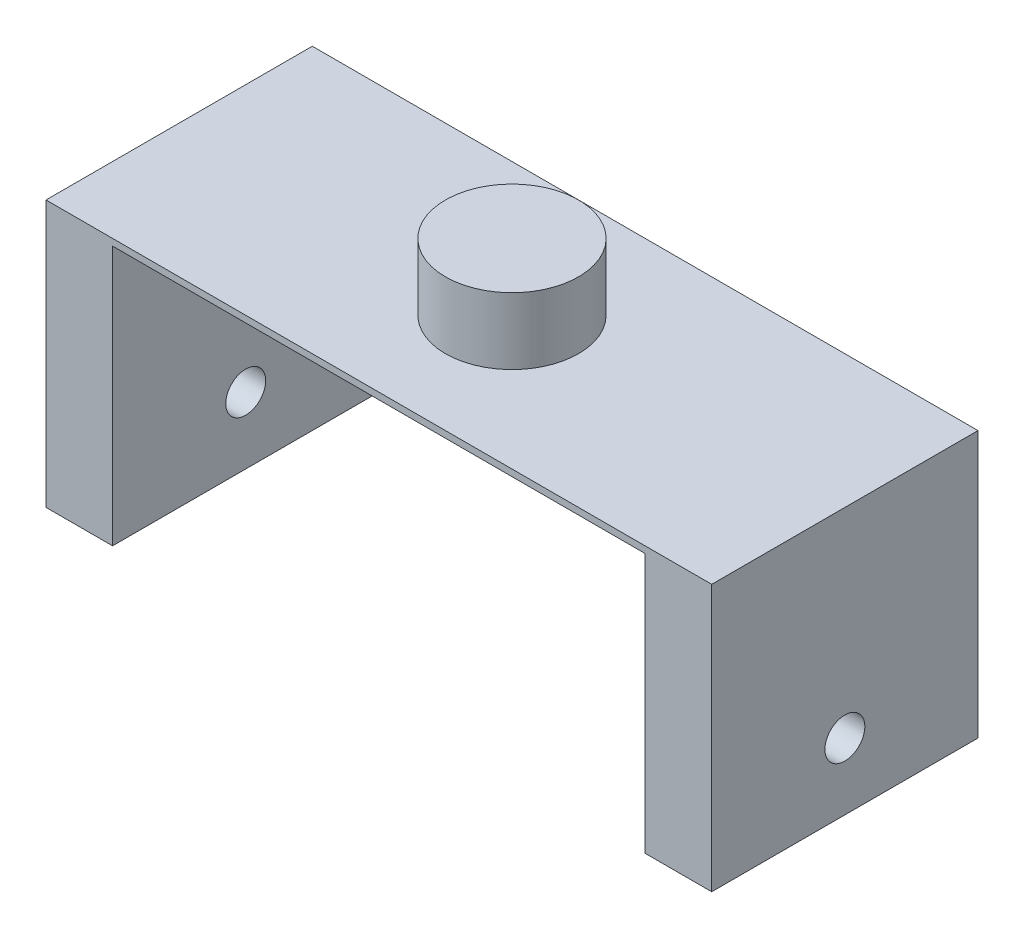
ISO-10303-21;
HEADER;
FILE_DESCRIPTION(('STEP AP214'),'2;1');
FILE_NAME('part.step','',(''),(''),'','','');
FILE_SCHEMA(('AUTOMOTIVE_DESIGN { 1 0 10303 214 1 1 1 1 }'));
ENDSEC;
DATA;
#1=APPLICATION_CONTEXT('core data for automotive mechanical design processes');
#2=APPLICATION_PROTOCOL_DEFINITION('international standard','automotive_design',2000,#1);
#3=PRODUCT_CONTEXT('',#1,'mechanical');
#4=PRODUCT('Part','Part','',(#3));
#5=PRODUCT_RELATED_PRODUCT_CATEGORY('part','',(#4));
#6=PRODUCT_DEFINITION_FORMATION('','',#4);
#7=PRODUCT_DEFINITION_CONTEXT('part definition',#1,'design');
#8=PRODUCT_DEFINITION('design','',#6,#7);
#9=PRODUCT_DEFINITION_SHAPE('','',#8);
#10=(LENGTH_UNIT() NAMED_UNIT(*) SI_UNIT(.MILLI.,.METRE.));
#11=(NAMED_UNIT(*) PLANE_ANGLE_UNIT() SI_UNIT($,.RADIAN.));
#12=(NAMED_UNIT(*) SI_UNIT($,.STERADIAN.) SOLID_ANGLE_UNIT());
#13=UNCERTAINTY_MEASURE_WITH_UNIT(LENGTH_MEASURE(1.E-05),#10,'distance_accuracy_value','');
#14=(GEOMETRIC_REPRESENTATION_CONTEXT(3) GLOBAL_UNCERTAINTY_ASSIGNED_CONTEXT((#13)) GLOBAL_UNIT_ASSIGNED_CONTEXT((#10,
#11,#12)) REPRESENTATION_CONTEXT('',''));
#15=CARTESIAN_POINT('',(0.,0.,0.));
#16=DIRECTION('',(0.,0.,1.));
#17=DIRECTION('',(1.,0.,0.));
#18=AXIS2_PLACEMENT_3D('',#15,#16,#17);
#19=CARTESIAN_POINT('',(0.,0.254,0.));
#20=DIRECTION('',(1.,0.,0.));
#21=DIRECTION('',(0.,0.,-1.));
#22=AXIS2_PLACEMENT_3D('',#19,#20,#21);
#23=PLANE('',#22);
#24=CARTESIAN_POINT('',(0.,-7.366,5.08));
#25=DIRECTION('',(-1.,0.,0.));
#26=DIRECTION('',(0.,0.,1.));
#27=AXIS2_PLACEMENT_3D('',#24,#25,#26);
#28=CIRCLE('',#27,0.761999999999999);
#29=CARTESIAN_POINT('',(0.,-7.366,5.842));
#30=VERTEX_POINT('',#29);
#31=EDGE_CURVE('E244',#30,#30,#28,.T.);
#32=ORIENTED_EDGE('',*,*,#31,.F.);
#33=EDGE_LOOP('',(#32));
#34=FACE_BOUND('',#33,.T.);
#35=DIRECTION('',(0.,-1.,0.));
#36=VECTOR('',#35,1.);
#37=CARTESIAN_POINT('',(0.,0.254,0.));
#38=LINE('',#37,#36);
#39=CARTESIAN_POINT('',(0.,0.254,0.));
#40=VERTEX_POINT('',#39);
#41=CARTESIAN_POINT('',(0.,-9.906,0.));
#42=VERTEX_POINT('',#41);
#43=EDGE_CURVE('E116',#40,#42,#38,.T.);
#44=ORIENTED_EDGE('',*,*,#43,.T.);
#45=DIRECTION('',(0.,0.,1.));
#46=VECTOR('',#45,1.);
#47=CARTESIAN_POINT('',(0.,-9.906,0.));
#48=LINE('',#47,#46);
#49=CARTESIAN_POINT('',(0.,-9.906,10.16));
#50=VERTEX_POINT('',#49);
#51=EDGE_CURVE('E147',#42,#50,#48,.T.);
#52=ORIENTED_EDGE('',*,*,#51,.T.);
#53=DIRECTION('',(0.,-1.,0.));
#54=VECTOR('',#53,1.);
#55=CARTESIAN_POINT('',(0.,0.254,10.16));
#56=LINE('',#55,#54);
#57=CARTESIAN_POINT('',(0.,0.254,10.16));
#58=VERTEX_POINT('',#57);
#59=EDGE_CURVE('E179',#58,#50,#56,.T.);
#60=ORIENTED_EDGE('',*,*,#59,.F.);
#61=DIRECTION('',(0.,0.,1.));
#62=VECTOR('',#61,1.);
#63=CARTESIAN_POINT('',(0.,0.254,0.));
#64=LINE('',#63,#62);
#65=EDGE_CURVE('E180',#40,#58,#64,.T.);
#66=ORIENTED_EDGE('',*,*,#65,.F.);
#67=EDGE_LOOP('',(#44,#52,#60,#66));
#68=FACE_BOUND('',#67,.T.);
#69=ADVANCED_FACE('F39',(#34,#68),#23,.F.);
#70=CARTESIAN_POINT('',(0.,0.254,10.16));
#71=DIRECTION('',(0.,0.,-1.));
#72=DIRECTION('',(-1.,0.,0.));
#73=AXIS2_PLACEMENT_3D('',#70,#71,#72);
#74=PLANE('',#73);
#75=DIRECTION('',(1.,0.,0.));
#76=VECTOR('',#75,1.);
#77=CARTESIAN_POINT('',(0.,0.,10.16));
#78=LINE('',#77,#76);
#79=CARTESIAN_POINT('',(2.54,0.,10.16));
#80=VERTEX_POINT('',#79);
#81=CARTESIAN_POINT('',(22.86,0.,10.16));
#82=VERTEX_POINT('',#81);
#83=EDGE_CURVE('E174',#80,#82,#78,.T.);
#84=ORIENTED_EDGE('',*,*,#83,.T.);
#85=DIRECTION('',(0.,1.,0.));
#86=VECTOR('',#85,1.);
#87=CARTESIAN_POINT('',(22.86,-9.906,10.16));
#88=LINE('',#87,#86);
#89=CARTESIAN_POINT('',(22.86,-9.906,10.16));
#90=VERTEX_POINT('',#89);
#91=EDGE_CURVE('E144',#90,#82,#88,.T.);
#92=ORIENTED_EDGE('',*,*,#91,.F.);
#93=DIRECTION('',(1.,0.,0.));
#94=VECTOR('',#93,1.);
#95=CARTESIAN_POINT('',(25.4,-9.906,10.16));
#96=LINE('',#95,#94);
#97=CARTESIAN_POINT('',(25.4,-9.906,10.16));
#98=VERTEX_POINT('',#97);
#99=EDGE_CURVE('E141',#90,#98,#96,.T.);
#100=ORIENTED_EDGE('',*,*,#99,.T.);
#101=DIRECTION('',(0.,-1.,0.));
#102=VECTOR('',#101,1.);
#103=CARTESIAN_POINT('',(25.4,0.254,10.16));
#104=LINE('',#103,#102);
#105=CARTESIAN_POINT('',(25.4,0.254,10.16));
#106=VERTEX_POINT('',#105);
#107=EDGE_CURVE('E115',#106,#98,#104,.T.);
#108=ORIENTED_EDGE('',*,*,#107,.F.);
#109=DIRECTION('',(1.,0.,0.));
#110=VECTOR('',#109,1.);
#111=CARTESIAN_POINT('',(0.,0.254,10.16));
#112=LINE('',#111,#110);
#113=EDGE_CURVE('E184',#58,#106,#112,.T.);
#114=ORIENTED_EDGE('',*,*,#113,.F.);
#115=ORIENTED_EDGE('',*,*,#59,.T.);
#116=DIRECTION('',(1.,0.,0.));
#117=VECTOR('',#116,1.);
#118=CARTESIAN_POINT('',(0.,-9.906,10.16));
#119=LINE('',#118,#117);
#120=CARTESIAN_POINT('',(2.54,-9.906,10.16));
#121=VERTEX_POINT('',#120);
#122=EDGE_CURVE('E153',#50,#121,#119,.T.);
#123=ORIENTED_EDGE('',*,*,#122,.T.);
#124=DIRECTION('',(0.,1.,0.));
#125=VECTOR('',#124,1.);
#126=CARTESIAN_POINT('',(2.54,-9.906,10.16));
#127=LINE('',#126,#125);
#128=EDGE_CURVE('E63',#121,#80,#127,.T.);
#129=ORIENTED_EDGE('',*,*,#128,.T.);
#130=EDGE_LOOP('',(#84,#92,#100,#108,#114,#115,#123,#129));
#131=FACE_BOUND('',#130,.T.);
#132=ADVANCED_FACE('F223',(#131),#74,.F.);
#133=CARTESIAN_POINT('',(25.4,0.254,0.));
#134=DIRECTION('',(-1.,0.,0.));
#135=DIRECTION('',(0.,0.,1.));
#136=AXIS2_PLACEMENT_3D('',#133,#134,#135);
#137=PLANE('',#136);
#138=CARTESIAN_POINT('',(25.4,-7.366,5.08));
#139=DIRECTION('',(-1.,0.,0.));
#140=DIRECTION('',(0.,0.,1.));
#141=AXIS2_PLACEMENT_3D('',#138,#139,#140);
#142=CIRCLE('',#141,0.761999999999999);
#143=CARTESIAN_POINT('',(25.4,-7.366,5.842));
#144=VERTEX_POINT('',#143);
#145=EDGE_CURVE('E247',#144,#144,#142,.T.);
#146=ORIENTED_EDGE('',*,*,#145,.T.);
#147=EDGE_LOOP('',(#146));
#148=FACE_BOUND('',#147,.T.);
#149=ORIENTED_EDGE('',*,*,#107,.T.);
#150=DIRECTION('',(0.,0.,-1.));
#151=VECTOR('',#150,1.);
#152=CARTESIAN_POINT('',(25.4,-9.906,0.));
#153=LINE('',#152,#151);
#154=CARTESIAN_POINT('',(25.4,-9.906,0.));
#155=VERTEX_POINT('',#154);
#156=EDGE_CURVE('E123',#98,#155,#153,.T.);
#157=ORIENTED_EDGE('',*,*,#156,.T.);
#158=DIRECTION('',(0.,-1.,0.));
#159=VECTOR('',#158,1.);
#160=CARTESIAN_POINT('',(25.4,0.254,0.));
#161=LINE('',#160,#159);
#162=CARTESIAN_POINT('',(25.4,0.254,0.));
#163=VERTEX_POINT('',#162);
#164=EDGE_CURVE('E105',#163,#155,#161,.T.);
#165=ORIENTED_EDGE('',*,*,#164,.F.);
#166=DIRECTION('',(0.,0.,-1.));
#167=VECTOR('',#166,1.);
#168=CARTESIAN_POINT('',(25.4,0.254,0.));
#169=LINE('',#168,#167);
#170=EDGE_CURVE('E188',#106,#163,#169,.T.);
#171=ORIENTED_EDGE('',*,*,#170,.F.);
#172=EDGE_LOOP('',(#149,#157,#165,#171));
#173=FACE_BOUND('',#172,.T.);
#174=ADVANCED_FACE('F129',(#148,#173),#137,.F.);
#175=CARTESIAN_POINT('',(0.,0.254,0.));
#176=DIRECTION('',(0.,0.,1.));
#177=DIRECTION('',(1.,0.,0.));
#178=AXIS2_PLACEMENT_3D('',#175,#176,#177);
#179=PLANE('',#178);
#180=ORIENTED_EDGE('',*,*,#43,.F.);
#181=DIRECTION('',(-1.,0.,0.));
#182=VECTOR('',#181,1.);
#183=CARTESIAN_POINT('',(0.,0.254,0.));
#184=LINE('',#183,#182);
#185=EDGE_CURVE('E110',#163,#40,#184,.T.);
#186=ORIENTED_EDGE('',*,*,#185,.F.);
#187=ORIENTED_EDGE('',*,*,#164,.T.);
#188=DIRECTION('',(-1.,0.,0.));
#189=VECTOR('',#188,1.);
#190=CARTESIAN_POINT('',(25.4,-9.906,0.));
#191=LINE('',#190,#189);
#192=CARTESIAN_POINT('',(22.86,-9.906,0.));
#193=VERTEX_POINT('',#192);
#194=EDGE_CURVE('E109',#155,#193,#191,.T.);
#195=ORIENTED_EDGE('',*,*,#194,.T.);
#196=DIRECTION('',(0.,1.,0.));
#197=VECTOR('',#196,1.);
#198=CARTESIAN_POINT('',(22.86,-9.906,0.));
#199=LINE('',#198,#197);
#200=CARTESIAN_POINT('',(22.86,0.,0.));
#201=VERTEX_POINT('',#200);
#202=EDGE_CURVE('E55',#193,#201,#199,.T.);
#203=ORIENTED_EDGE('',*,*,#202,.T.);
#204=DIRECTION('',(-1.,0.,0.));
#205=VECTOR('',#204,1.);
#206=CARTESIAN_POINT('',(0.,0.,0.));
#207=LINE('',#206,#205);
#208=CARTESIAN_POINT('',(2.54,0.,0.));
#209=VERTEX_POINT('',#208);
#210=EDGE_CURVE('E185',#201,#209,#207,.T.);
#211=ORIENTED_EDGE('',*,*,#210,.T.);
#212=DIRECTION('',(0.,1.,0.));
#213=VECTOR('',#212,1.);
#214=CARTESIAN_POINT('',(2.54,-9.906,0.));
#215=LINE('',#214,#213);
#216=CARTESIAN_POINT('',(2.54,-9.906,0.));
#217=VERTEX_POINT('',#216);
#218=EDGE_CURVE('E164',#217,#209,#215,.T.);
#219=ORIENTED_EDGE('',*,*,#218,.F.);
#220=DIRECTION('',(-1.,0.,0.));
#221=VECTOR('',#220,1.);
#222=CARTESIAN_POINT('',(0.,-9.906,0.));
#223=LINE('',#222,#221);
#224=EDGE_CURVE('E160',#217,#42,#223,.T.);
#225=ORIENTED_EDGE('',*,*,#224,.T.);
#226=EDGE_LOOP('',(#180,#186,#187,#195,#203,#211,#219,#225));
#227=FACE_BOUND('',#226,.T.);
#228=ADVANCED_FACE('F108',(#227),#179,.F.);
#229=CARTESIAN_POINT('',(0.,0.254,0.));
#230=DIRECTION('',(0.,1.,0.));
#231=DIRECTION('',(0.,0.,1.));
#232=AXIS2_PLACEMENT_3D('',#229,#230,#231);
#233=PLANE('',#232);
#234=ORIENTED_EDGE('',*,*,#113,.T.);
#235=ORIENTED_EDGE('',*,*,#170,.T.);
#236=ORIENTED_EDGE('',*,*,#185,.T.);
#237=ORIENTED_EDGE('',*,*,#65,.T.);
#238=EDGE_LOOP('',(#234,#235,#236,#237));
#239=FACE_BOUND('',#238,.T.);
#240=CARTESIAN_POINT('',(12.7,0.254,5.08));
#241=DIRECTION('',(0.,1.,0.));
#242=DIRECTION('',(0.,0.,1.));
#243=AXIS2_PLACEMENT_3D('',#240,#241,#242);
#244=CIRCLE('',#243,2.54);
#245=CARTESIAN_POINT('',(12.7,0.254,7.62));
#246=VERTEX_POINT('',#245);
#247=EDGE_CURVE('E175',#246,#246,#244,.T.);
#248=ORIENTED_EDGE('',*,*,#247,.F.);
#249=EDGE_LOOP('',(#248));
#250=FACE_BOUND('',#249,.T.);
#251=ADVANCED_FACE('F221',(#239,#250),#233,.T.);
#252=CARTESIAN_POINT('',(0.,0.,0.));
#253=DIRECTION('',(0.,1.,0.));
#254=DIRECTION('',(0.,0.,1.));
#255=AXIS2_PLACEMENT_3D('',#252,#253,#254);
#256=PLANE('',#255);
#257=ORIENTED_EDGE('',*,*,#210,.F.);
#258=DIRECTION('',(0.,0.,1.));
#259=VECTOR('',#258,1.);
#260=CARTESIAN_POINT('',(22.86,0.,0.));
#261=LINE('',#260,#259);
#262=EDGE_CURVE('E11',#201,#82,#261,.T.);
#263=ORIENTED_EDGE('',*,*,#262,.T.);
#264=ORIENTED_EDGE('',*,*,#83,.F.);
#265=DIRECTION('',(0.,0.,-1.));
#266=VECTOR('',#265,1.);
#267=CARTESIAN_POINT('',(2.54,0.,0.));
#268=LINE('',#267,#266);
#269=EDGE_CURVE('E48',#80,#209,#268,.T.);
#270=ORIENTED_EDGE('',*,*,#269,.T.);
#271=EDGE_LOOP('',(#257,#263,#264,#270));
#272=FACE_BOUND('',#271,.T.);
#273=ADVANCED_FACE('F208',(#272),#256,.F.);
#274=CARTESIAN_POINT('',(12.7,2.794,5.08));
#275=DIRECTION('',(0.,-1.,0.));
#276=DIRECTION('',(0.,0.,-1.));
#277=AXIS2_PLACEMENT_3D('',#274,#275,#276);
#278=CYLINDRICAL_SURFACE('',#277,2.54);
#279=CARTESIAN_POINT('',(12.7,2.794,5.08));
#280=DIRECTION('',(0.,1.,0.));
#281=DIRECTION('',(0.,0.,1.));
#282=AXIS2_PLACEMENT_3D('',#279,#280,#281);
#283=CIRCLE('',#282,2.54);
#284=CARTESIAN_POINT('',(12.7,2.794,7.62));
#285=VERTEX_POINT('',#284);
#286=EDGE_CURVE('E168',#285,#285,#283,.T.);
#287=ORIENTED_EDGE('',*,*,#286,.F.);
#288=EDGE_LOOP('',(#287));
#289=FACE_BOUND('',#288,.T.);
#290=ORIENTED_EDGE('',*,*,#247,.T.);
#291=EDGE_LOOP('',(#290));
#292=FACE_BOUND('',#291,.T.);
#293=ADVANCED_FACE('F274',(#289,#292),#278,.T.);
#294=CARTESIAN_POINT('',(12.7,2.794,5.08));
#295=DIRECTION('',(0.,1.,0.));
#296=DIRECTION('',(0.,0.,1.));
#297=AXIS2_PLACEMENT_3D('',#294,#295,#296);
#298=PLANE('',#297);
#299=ORIENTED_EDGE('',*,*,#286,.T.);
#300=EDGE_LOOP('',(#299));
#301=FACE_BOUND('',#300,.T.);
#302=ADVANCED_FACE('F269',(#301),#298,.T.);
#303=CARTESIAN_POINT('',(2.54,-9.906,0.));
#304=DIRECTION('',(1.,0.,0.));
#305=DIRECTION('',(0.,0.,-1.));
#306=AXIS2_PLACEMENT_3D('',#303,#304,#305);
#307=PLANE('',#306);
#308=CARTESIAN_POINT('',(2.54,-7.366,5.08));
#309=DIRECTION('',(1.,0.,0.));
#310=DIRECTION('',(0.,0.,-1.));
#311=AXIS2_PLACEMENT_3D('',#308,#309,#310);
#312=CIRCLE('',#311,0.761999999999999);
#313=CARTESIAN_POINT('',(2.54,-7.366,4.318));
#314=VERTEX_POINT('',#313);
#315=EDGE_CURVE('E132',#314,#314,#312,.T.);
#316=ORIENTED_EDGE('',*,*,#315,.F.);
#317=EDGE_LOOP('',(#316));
#318=FACE_BOUND('',#317,.T.);
#319=ORIENTED_EDGE('',*,*,#269,.F.);
#320=ORIENTED_EDGE('',*,*,#128,.F.);
#321=DIRECTION('',(0.,0.,-1.));
#322=VECTOR('',#321,1.);
#323=CARTESIAN_POINT('',(2.54,-9.906,0.));
#324=LINE('',#323,#322);
#325=EDGE_CURVE('E156',#121,#217,#324,.T.);
#326=ORIENTED_EDGE('',*,*,#325,.T.);
#327=ORIENTED_EDGE('',*,*,#218,.T.);
#328=EDGE_LOOP('',(#319,#320,#326,#327));
#329=FACE_BOUND('',#328,.T.);
#330=ADVANCED_FACE('F210',(#318,#329),#307,.T.);
#331=CARTESIAN_POINT('',(0.,-9.906,0.));
#332=DIRECTION('',(0.,1.,0.));
#333=DIRECTION('',(0.,0.,1.));
#334=AXIS2_PLACEMENT_3D('',#331,#332,#333);
#335=PLANE('',#334);
#336=ORIENTED_EDGE('',*,*,#51,.F.);
#337=ORIENTED_EDGE('',*,*,#224,.F.);
#338=ORIENTED_EDGE('',*,*,#325,.F.);
#339=ORIENTED_EDGE('',*,*,#122,.F.);
#340=EDGE_LOOP('',(#336,#337,#338,#339));
#341=FACE_BOUND('',#340,.T.);
#342=ADVANCED_FACE('F216',(#341),#335,.F.);
#343=CARTESIAN_POINT('',(22.86,-9.906,0.));
#344=DIRECTION('',(-1.,0.,0.));
#345=DIRECTION('',(0.,0.,1.));
#346=AXIS2_PLACEMENT_3D('',#343,#344,#345);
#347=PLANE('',#346);
#348=CARTESIAN_POINT('',(22.86,-7.366,5.08));
#349=DIRECTION('',(-1.,0.,0.));
#350=DIRECTION('',(0.,0.,1.));
#351=AXIS2_PLACEMENT_3D('',#348,#349,#350);
#352=CIRCLE('',#351,0.761999999999999);
#353=CARTESIAN_POINT('',(22.86,-7.366,5.842));
#354=VERTEX_POINT('',#353);
#355=EDGE_CURVE('E42',#354,#354,#352,.T.);
#356=ORIENTED_EDGE('',*,*,#355,.F.);
#357=EDGE_LOOP('',(#356));
#358=FACE_BOUND('',#357,.T.);
#359=ORIENTED_EDGE('',*,*,#262,.F.);
#360=ORIENTED_EDGE('',*,*,#202,.F.);
#361=DIRECTION('',(0.,0.,1.));
#362=VECTOR('',#361,1.);
#363=CARTESIAN_POINT('',(22.86,-9.906,0.));
#364=LINE('',#363,#362);
#365=EDGE_CURVE('E126',#193,#90,#364,.T.);
#366=ORIENTED_EDGE('',*,*,#365,.T.);
#367=ORIENTED_EDGE('',*,*,#91,.T.);
#368=EDGE_LOOP('',(#359,#360,#366,#367));
#369=FACE_BOUND('',#368,.T.);
#370=ADVANCED_FACE('F225',(#358,#369),#347,.T.);
#371=CARTESIAN_POINT('',(0.,-9.906,0.));
#372=DIRECTION('',(0.,-1.,0.));
#373=DIRECTION('',(0.,0.,-1.));
#374=AXIS2_PLACEMENT_3D('',#371,#372,#373);
#375=PLANE('',#374);
#376=ORIENTED_EDGE('',*,*,#156,.F.);
#377=ORIENTED_EDGE('',*,*,#99,.F.);
#378=ORIENTED_EDGE('',*,*,#365,.F.);
#379=ORIENTED_EDGE('',*,*,#194,.F.);
#380=EDGE_LOOP('',(#376,#377,#378,#379));
#381=FACE_BOUND('',#380,.T.);
#382=ADVANCED_FACE('F121',(#381),#375,.T.);
#383=CARTESIAN_POINT('',(25.4,-7.366,5.08));
#384=DIRECTION('',(-1.,0.,0.));
#385=DIRECTION('',(0.,0.,1.));
#386=AXIS2_PLACEMENT_3D('',#383,#384,#385);
#387=CYLINDRICAL_SURFACE('',#386,0.761999999999999);
#388=ORIENTED_EDGE('',*,*,#355,.T.);
#389=EDGE_LOOP('',(#388));
#390=FACE_BOUND('',#389,.T.);
#391=ORIENTED_EDGE('',*,*,#145,.F.);
#392=EDGE_LOOP('',(#391));
#393=FACE_BOUND('',#392,.T.);
#394=ADVANCED_FACE('F233',(#390,#393),#387,.F.);
#395=ORIENTED_EDGE('',*,*,#315,.T.);
#396=EDGE_LOOP('',(#395));
#397=FACE_BOUND('',#396,.T.);
#398=ORIENTED_EDGE('',*,*,#31,.T.);
#399=EDGE_LOOP('',(#398));
#400=FACE_BOUND('',#399,.T.);
#401=ADVANCED_FACE('F258',(#397,#400),#387,.F.);
#402=CLOSED_SHELL('',(#69,#132,#174,#228,#251,#273,#293,#302,#330,#342,#370,#382,#394,#401));
#403=MANIFOLD_SOLID_BREP('B2',#402);
#404=ADVANCED_BREP_SHAPE_REPRESENTATION('',(#18,#403),#14);
#405=SHAPE_DEFINITION_REPRESENTATION(#9,#404);
ENDSEC;
END-ISO-10303-21;
